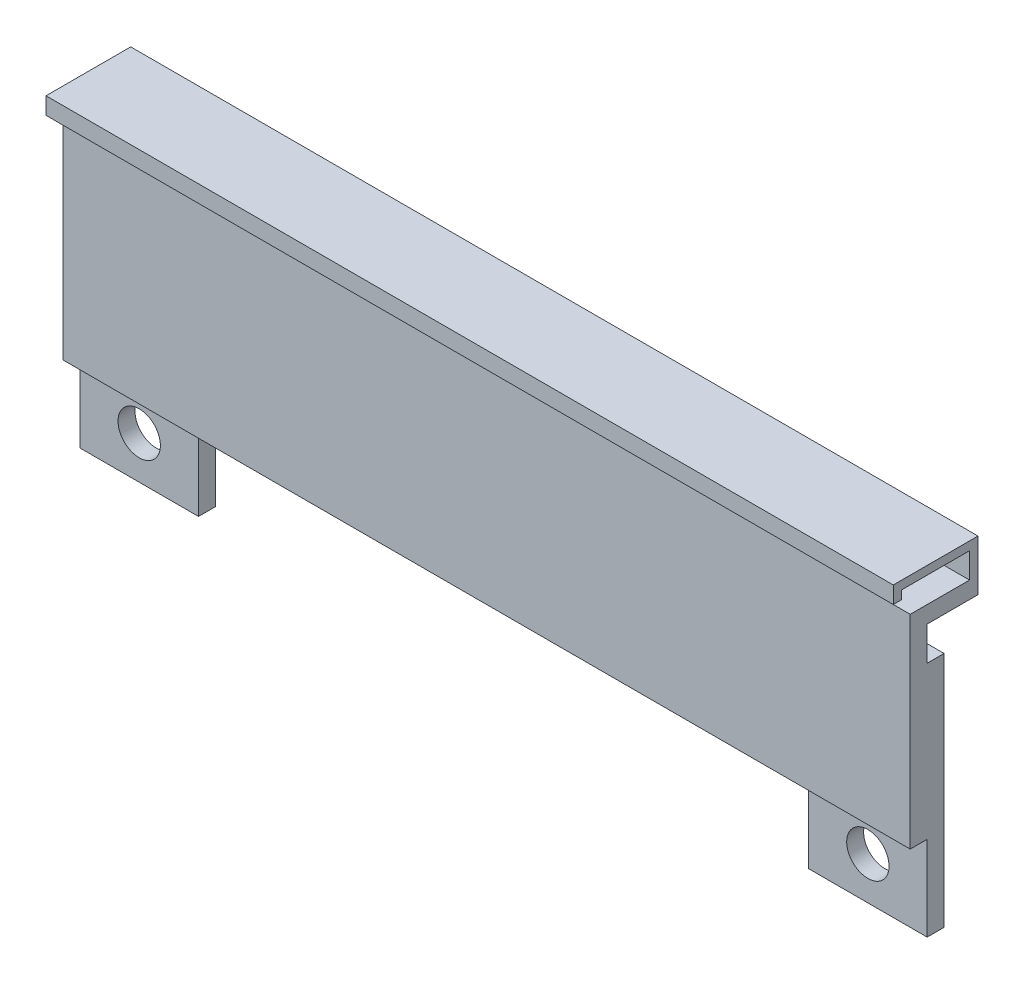
ISO-10303-21;
HEADER;
FILE_DESCRIPTION(('STEP AP214'),'2;1');
FILE_NAME('part.step','',(''),(''),'','','');
FILE_SCHEMA(('AUTOMOTIVE_DESIGN { 1 0 10303 214 1 1 1 1 }'));
ENDSEC;
DATA;
#1=APPLICATION_CONTEXT('core data for automotive mechanical design processes');
#2=APPLICATION_PROTOCOL_DEFINITION('international standard','automotive_design',2000,#1);
#3=PRODUCT_CONTEXT('',#1,'mechanical');
#4=PRODUCT('Part','Part','',(#3));
#5=PRODUCT_RELATED_PRODUCT_CATEGORY('part','',(#4));
#6=PRODUCT_DEFINITION_FORMATION('','',#4);
#7=PRODUCT_DEFINITION_CONTEXT('part definition',#1,'design');
#8=PRODUCT_DEFINITION('design','',#6,#7);
#9=PRODUCT_DEFINITION_SHAPE('','',#8);
#10=(LENGTH_UNIT() NAMED_UNIT(*) SI_UNIT(.MILLI.,.METRE.));
#11=(NAMED_UNIT(*) PLANE_ANGLE_UNIT() SI_UNIT($,.RADIAN.));
#12=(NAMED_UNIT(*) SI_UNIT($,.STERADIAN.) SOLID_ANGLE_UNIT());
#13=UNCERTAINTY_MEASURE_WITH_UNIT(LENGTH_MEASURE(1.E-05),#10,'distance_accuracy_value','');
#14=(GEOMETRIC_REPRESENTATION_CONTEXT(3) GLOBAL_UNCERTAINTY_ASSIGNED_CONTEXT((#13)) GLOBAL_UNIT_ASSIGNED_CONTEXT((#10,
#11,#12)) REPRESENTATION_CONTEXT('',''));
#15=CARTESIAN_POINT('',(0.,0.,0.));
#16=DIRECTION('',(0.,0.,1.));
#17=DIRECTION('',(1.,0.,0.));
#18=AXIS2_PLACEMENT_3D('',#15,#16,#17);
#19=CARTESIAN_POINT('',(0.,0.,-2.));
#20=DIRECTION('',(0.,0.,1.));
#21=DIRECTION('',(1.,0.,0.));
#22=AXIS2_PLACEMENT_3D('',#19,#20,#21);
#23=PLANE('',#22);
#24=DIRECTION('',(0.,-1.,0.));
#25=VECTOR('',#24,1.);
#26=CARTESIAN_POINT('',(-86.,0.,-2.));
#27=LINE('',#26,#25);
#28=CARTESIAN_POINT('',(-86.,10.,-2.));
#29=VERTEX_POINT('',#28);
#30=CARTESIAN_POINT('',(-86.,0.,-2.));
#31=VERTEX_POINT('',#30);
#32=EDGE_CURVE('E183',#29,#31,#27,.T.);
#33=ORIENTED_EDGE('',*,*,#32,.F.);
#34=DIRECTION('',(-1.,0.,0.));
#35=VECTOR('',#34,1.);
#36=CARTESIAN_POINT('',(0.,10.,-2.));
#37=LINE('',#36,#35);
#38=CARTESIAN_POINT('',(-100.,10.,-2.));
#39=VERTEX_POINT('',#38);
#40=EDGE_CURVE('E314',#29,#39,#37,.T.);
#41=ORIENTED_EDGE('',*,*,#40,.T.);
#42=DIRECTION('',(0.,1.,0.));
#43=VECTOR('',#42,1.);
#44=CARTESIAN_POINT('',(-100.,28.,-2.));
#45=LINE('',#44,#43);
#46=CARTESIAN_POINT('',(-100.,0.,-2.));
#47=VERTEX_POINT('',#46);
#48=EDGE_CURVE('E211',#47,#39,#45,.T.);
#49=ORIENTED_EDGE('',*,*,#48,.F.);
#50=DIRECTION('',(-1.,0.,0.));
#51=VECTOR('',#50,1.);
#52=CARTESIAN_POINT('',(-100.,0.,-2.));
#53=LINE('',#52,#51);
#54=EDGE_CURVE('E218',#31,#47,#53,.T.);
#55=ORIENTED_EDGE('',*,*,#54,.F.);
#56=EDGE_LOOP('',(#33,#41,#49,#55));
#57=FACE_BOUND('',#56,.T.);
#58=CARTESIAN_POINT('',(-93.,4.99999999999998,-2.));
#59=DIRECTION('',(0.,0.,-1.));
#60=DIRECTION('',(-1.,0.,0.));
#61=AXIS2_PLACEMENT_3D('',#58,#59,#60);
#62=CIRCLE('',#61,2.5);
#63=CARTESIAN_POINT('',(-95.5,4.99999999999998,-2.));
#64=VERTEX_POINT('',#63);
#65=EDGE_CURVE('E380',#64,#64,#62,.T.);
#66=ORIENTED_EDGE('',*,*,#65,.T.);
#67=EDGE_LOOP('',(#66));
#68=FACE_BOUND('',#67,.T.);
#69=ADVANCED_FACE('F40',(#57,#68),#23,.T.);
#70=CARTESIAN_POINT('',(-100.,0.,-4.));
#71=DIRECTION('',(0.,1.,0.));
#72=DIRECTION('',(0.,0.,1.));
#73=AXIS2_PLACEMENT_3D('',#70,#71,#72);
#74=PLANE('',#73);
#75=DIRECTION('',(-1.,0.,0.));
#76=VECTOR('',#75,1.);
#77=CARTESIAN_POINT('',(-100.,0.,-4.));
#78=LINE('',#77,#76);
#79=CARTESIAN_POINT('',(-86.,0.,-4.));
#80=VERTEX_POINT('',#79);
#81=CARTESIAN_POINT('',(-100.,0.,-4.));
#82=VERTEX_POINT('',#81);
#83=EDGE_CURVE('E194',#80,#82,#78,.T.);
#84=ORIENTED_EDGE('',*,*,#83,.F.);
#85=DIRECTION('',(0.,0.,1.));
#86=VECTOR('',#85,1.);
#87=CARTESIAN_POINT('',(-86.,0.,-4.));
#88=LINE('',#87,#86);
#89=EDGE_CURVE('E177',#80,#31,#88,.T.);
#90=ORIENTED_EDGE('',*,*,#89,.T.);
#91=ORIENTED_EDGE('',*,*,#54,.T.);
#92=DIRECTION('',(0.,0.,1.));
#93=VECTOR('',#92,1.);
#94=CARTESIAN_POINT('',(-100.,0.,-4.));
#95=LINE('',#94,#93);
#96=EDGE_CURVE('E201',#82,#47,#95,.T.);
#97=ORIENTED_EDGE('',*,*,#96,.F.);
#98=EDGE_LOOP('',(#84,#90,#91,#97));
#99=FACE_BOUND('',#98,.T.);
#100=ADVANCED_FACE('F199',(#99),#74,.F.);
#101=CARTESIAN_POINT('',(-100.,0.,2.));
#102=DIRECTION('',(-1.,0.,0.));
#103=DIRECTION('',(0.,0.,1.));
#104=AXIS2_PLACEMENT_3D('',#101,#102,#103);
#105=PLANE('',#104);
#106=DIRECTION('',(0.,0.,1.));
#107=VECTOR('',#106,1.);
#108=CARTESIAN_POINT('',(-100.,10.,-2.));
#109=LINE('',#108,#107);
#110=CARTESIAN_POINT('',(-100.,10.,0.));
#111=VERTEX_POINT('',#110);
#112=EDGE_CURVE('E48',#39,#111,#109,.T.);
#113=ORIENTED_EDGE('',*,*,#112,.T.);
#114=DIRECTION('',(0.,1.,0.));
#115=VECTOR('',#114,1.);
#116=CARTESIAN_POINT('',(-100.,28.,0.));
#117=LINE('',#116,#115);
#118=CARTESIAN_POINT('',(-100.,34.,0.));
#119=VERTEX_POINT('',#118);
#120=EDGE_CURVE('E302',#111,#119,#117,.T.);
#121=ORIENTED_EDGE('',*,*,#120,.T.);
#122=DIRECTION('',(0.,0.,1.));
#123=VECTOR('',#122,1.);
#124=CARTESIAN_POINT('',(-100.,34.,-2.));
#125=LINE('',#124,#123);
#126=CARTESIAN_POINT('',(-100.,34.,-7.));
#127=VERTEX_POINT('',#126);
#128=EDGE_CURVE('E305',#127,#119,#125,.T.);
#129=ORIENTED_EDGE('',*,*,#128,.F.);
#130=DIRECTION('',(0.,1.,0.));
#131=VECTOR('',#130,1.);
#132=CARTESIAN_POINT('',(-100.,32.,-7.));
#133=LINE('',#132,#131);
#134=CARTESIAN_POINT('',(-100.,37.,-7.));
#135=VERTEX_POINT('',#134);
#136=EDGE_CURVE('E269',#127,#135,#133,.T.);
#137=ORIENTED_EDGE('',*,*,#136,.T.);
#138=DIRECTION('',(0.,0.,-1.));
#139=VECTOR('',#138,1.);
#140=CARTESIAN_POINT('',(-100.,37.,2.));
#141=LINE('',#140,#139);
#142=CARTESIAN_POINT('',(-100.,37.,0.999999999999999));
#143=VERTEX_POINT('',#142);
#144=EDGE_CURVE('E264',#143,#135,#141,.T.);
#145=ORIENTED_EDGE('',*,*,#144,.F.);
#146=DIRECTION('',(0.,1.,0.));
#147=VECTOR('',#146,1.);
#148=CARTESIAN_POINT('',(-100.,36.,0.999999999999999));
#149=LINE('',#148,#147);
#150=CARTESIAN_POINT('',(-100.,36.,0.999999999999999));
#151=VERTEX_POINT('',#150);
#152=EDGE_CURVE('E249',#151,#143,#149,.T.);
#153=ORIENTED_EDGE('',*,*,#152,.F.);
#154=DIRECTION('',(0.,0.,-1.));
#155=VECTOR('',#154,1.);
#156=CARTESIAN_POINT('',(-100.,36.,2.));
#157=LINE('',#156,#155);
#158=CARTESIAN_POINT('',(-100.,36.,2.));
#159=VERTEX_POINT('',#158);
#160=EDGE_CURVE('E234',#159,#151,#157,.T.);
#161=ORIENTED_EDGE('',*,*,#160,.F.);
#162=DIRECTION('',(0.,-1.,0.));
#163=VECTOR('',#162,1.);
#164=CARTESIAN_POINT('',(-100.,38.,2.));
#165=LINE('',#164,#163);
#166=CARTESIAN_POINT('',(-100.,38.,2.));
#167=VERTEX_POINT('',#166);
#168=EDGE_CURVE('E252',#167,#159,#165,.T.);
#169=ORIENTED_EDGE('',*,*,#168,.F.);
#170=DIRECTION('',(0.,0.,-1.));
#171=VECTOR('',#170,1.);
#172=CARTESIAN_POINT('',(-100.,38.,-7.));
#173=LINE('',#172,#171);
#174=CARTESIAN_POINT('',(-100.,38.,-8.));
#175=VERTEX_POINT('',#174);
#176=EDGE_CURVE('E272',#167,#175,#173,.T.);
#177=ORIENTED_EDGE('',*,*,#176,.T.);
#178=DIRECTION('',(0.,1.,0.));
#179=VECTOR('',#178,1.);
#180=CARTESIAN_POINT('',(-100.,34.,-8.));
#181=LINE('',#180,#179);
#182=CARTESIAN_POINT('',(-100.,32.,-8.));
#183=VERTEX_POINT('',#182);
#184=EDGE_CURVE('E289',#183,#175,#181,.T.);
#185=ORIENTED_EDGE('',*,*,#184,.F.);
#186=DIRECTION('',(0.,0.,1.));
#187=VECTOR('',#186,1.);
#188=CARTESIAN_POINT('',(-100.,32.,-8.));
#189=LINE('',#188,#187);
#190=CARTESIAN_POINT('',(-100.,32.,-2.));
#191=VERTEX_POINT('',#190);
#192=EDGE_CURVE('E291',#183,#191,#189,.T.);
#193=ORIENTED_EDGE('',*,*,#192,.T.);
#194=DIRECTION('',(0.,1.,0.));
#195=VECTOR('',#194,1.);
#196=CARTESIAN_POINT('',(-100.,12.,-2.));
#197=LINE('',#196,#195);
#198=CARTESIAN_POINT('',(-100.,28.,-2.));
#199=VERTEX_POINT('',#198);
#200=EDGE_CURVE('E318',#199,#191,#197,.T.);
#201=ORIENTED_EDGE('',*,*,#200,.F.);
#202=DIRECTION('',(0.,0.,1.));
#203=VECTOR('',#202,1.);
#204=CARTESIAN_POINT('',(-100.,28.,-4.));
#205=LINE('',#204,#203);
#206=CARTESIAN_POINT('',(-100.,28.,-4.));
#207=VERTEX_POINT('',#206);
#208=EDGE_CURVE('E230',#207,#199,#205,.T.);
#209=ORIENTED_EDGE('',*,*,#208,.F.);
#210=DIRECTION('',(0.,1.,0.));
#211=VECTOR('',#210,1.);
#212=CARTESIAN_POINT('',(-100.,28.,-4.));
#213=LINE('',#212,#211);
#214=EDGE_CURVE('E222',#82,#207,#213,.T.);
#215=ORIENTED_EDGE('',*,*,#214,.F.);
#216=ORIENTED_EDGE('',*,*,#96,.T.);
#217=ORIENTED_EDGE('',*,*,#48,.T.);
#218=EDGE_LOOP('',(#113,#121,#129,#137,#145,#153,#161,#169,#177,#185,#193,#201,#209,#215,#216,#217));
#219=FACE_BOUND('',#218,.T.);
#220=ADVANCED_FACE('F42',(#219),#105,.T.);
#221=CARTESIAN_POINT('',(0.,0.,2.));
#222=DIRECTION('',(-1.,0.,0.));
#223=DIRECTION('',(0.,-1.,0.));
#224=AXIS2_PLACEMENT_3D('',#221,#222,#223);
#225=PLANE('',#224);
#226=DIRECTION('',(0.,1.,0.));
#227=VECTOR('',#226,1.);
#228=CARTESIAN_POINT('',(0.,28.,0.));
#229=LINE('',#228,#227);
#230=CARTESIAN_POINT('',(0.,10.,0.));
#231=VERTEX_POINT('',#230);
#232=CARTESIAN_POINT('',(0.,34.,0.));
#233=VERTEX_POINT('',#232);
#234=EDGE_CURVE('E301',#231,#233,#229,.T.);
#235=ORIENTED_EDGE('',*,*,#234,.F.);
#236=DIRECTION('',(0.,0.,1.));
#237=VECTOR('',#236,1.);
#238=CARTESIAN_POINT('',(0.,10.,-2.));
#239=LINE('',#238,#237);
#240=CARTESIAN_POINT('',(0.,10.,-2.));
#241=VERTEX_POINT('',#240);
#242=EDGE_CURVE('E11',#241,#231,#239,.T.);
#243=ORIENTED_EDGE('',*,*,#242,.F.);
#244=DIRECTION('',(0.,-1.,0.));
#245=VECTOR('',#244,1.);
#246=CARTESIAN_POINT('',(0.,28.,-2.));
#247=LINE('',#246,#245);
#248=CARTESIAN_POINT('',(0.,0.,-2.));
#249=VERTEX_POINT('',#248);
#250=EDGE_CURVE('E216',#241,#249,#247,.T.);
#251=ORIENTED_EDGE('',*,*,#250,.T.);
#252=DIRECTION('',(0.,0.,1.));
#253=VECTOR('',#252,1.);
#254=CARTESIAN_POINT('',(0.,0.,-4.));
#255=LINE('',#254,#253);
#256=CARTESIAN_POINT('',(0.,0.,-4.));
#257=VERTEX_POINT('',#256);
#258=EDGE_CURVE('E224',#257,#249,#255,.T.);
#259=ORIENTED_EDGE('',*,*,#258,.F.);
#260=DIRECTION('',(0.,-1.,0.));
#261=VECTOR('',#260,1.);
#262=CARTESIAN_POINT('',(0.,28.,-4.));
#263=LINE('',#262,#261);
#264=CARTESIAN_POINT('',(0.,28.,-4.));
#265=VERTEX_POINT('',#264);
#266=EDGE_CURVE('E204',#265,#257,#263,.T.);
#267=ORIENTED_EDGE('',*,*,#266,.F.);
#268=DIRECTION('',(0.,0.,1.));
#269=VECTOR('',#268,1.);
#270=CARTESIAN_POINT('',(0.,28.,-4.));
#271=LINE('',#270,#269);
#272=CARTESIAN_POINT('',(0.,28.,-2.));
#273=VERTEX_POINT('',#272);
#274=EDGE_CURVE('E227',#265,#273,#271,.T.);
#275=ORIENTED_EDGE('',*,*,#274,.T.);
#276=DIRECTION('',(0.,-1.,0.));
#277=VECTOR('',#276,1.);
#278=CARTESIAN_POINT('',(0.,12.,-2.));
#279=LINE('',#278,#277);
#280=CARTESIAN_POINT('',(0.,32.,-2.));
#281=VERTEX_POINT('',#280);
#282=EDGE_CURVE('E312',#281,#273,#279,.T.);
#283=ORIENTED_EDGE('',*,*,#282,.F.);
#284=DIRECTION('',(0.,0.,1.));
#285=VECTOR('',#284,1.);
#286=CARTESIAN_POINT('',(0.,32.,-8.));
#287=LINE('',#286,#285);
#288=CARTESIAN_POINT('',(0.,32.,-8.));
#289=VERTEX_POINT('',#288);
#290=EDGE_CURVE('E296',#289,#281,#287,.T.);
#291=ORIENTED_EDGE('',*,*,#290,.F.);
#292=DIRECTION('',(0.,-1.,0.));
#293=VECTOR('',#292,1.);
#294=CARTESIAN_POINT('',(0.,34.,-8.));
#295=LINE('',#294,#293);
#296=CARTESIAN_POINT('',(0.,38.,-8.));
#297=VERTEX_POINT('',#296);
#298=EDGE_CURVE('E284',#297,#289,#295,.T.);
#299=ORIENTED_EDGE('',*,*,#298,.F.);
#300=DIRECTION('',(0.,0.,-1.));
#301=VECTOR('',#300,1.);
#302=CARTESIAN_POINT('',(0.,38.,-7.));
#303=LINE('',#302,#301);
#304=CARTESIAN_POINT('',(0.,38.,2.));
#305=VERTEX_POINT('',#304);
#306=EDGE_CURVE('E275',#305,#297,#303,.T.);
#307=ORIENTED_EDGE('',*,*,#306,.F.);
#308=DIRECTION('',(0.,1.,0.));
#309=VECTOR('',#308,1.);
#310=CARTESIAN_POINT('',(0.,38.,2.));
#311=LINE('',#310,#309);
#312=CARTESIAN_POINT('',(0.,36.,2.));
#313=VERTEX_POINT('',#312);
#314=EDGE_CURVE('E254',#313,#305,#311,.T.);
#315=ORIENTED_EDGE('',*,*,#314,.F.);
#316=DIRECTION('',(0.,0.,1.));
#317=VECTOR('',#316,1.);
#318=CARTESIAN_POINT('',(0.,36.,2.));
#319=LINE('',#318,#317);
#320=CARTESIAN_POINT('',(0.,36.,0.999999999999999));
#321=VERTEX_POINT('',#320);
#322=EDGE_CURVE('E239',#321,#313,#319,.T.);
#323=ORIENTED_EDGE('',*,*,#322,.F.);
#324=DIRECTION('',(0.,1.,0.));
#325=VECTOR('',#324,1.);
#326=CARTESIAN_POINT('',(0.,36.,0.999999999999999));
#327=LINE('',#326,#325);
#328=CARTESIAN_POINT('',(0.,37.,0.999999999999999));
#329=VERTEX_POINT('',#328);
#330=EDGE_CURVE('E245',#321,#329,#327,.T.);
#331=ORIENTED_EDGE('',*,*,#330,.T.);
#332=DIRECTION('',(0.,0.,-1.));
#333=VECTOR('',#332,1.);
#334=CARTESIAN_POINT('',(0.,37.,2.));
#335=LINE('',#334,#333);
#336=CARTESIAN_POINT('',(0.,37.,-7.));
#337=VERTEX_POINT('',#336);
#338=EDGE_CURVE('E260',#329,#337,#335,.T.);
#339=ORIENTED_EDGE('',*,*,#338,.T.);
#340=DIRECTION('',(0.,-1.,0.));
#341=VECTOR('',#340,1.);
#342=CARTESIAN_POINT('',(0.,32.,-7.));
#343=LINE('',#342,#341);
#344=CARTESIAN_POINT('',(0.,34.,-7.));
#345=VERTEX_POINT('',#344);
#346=EDGE_CURVE('E267',#337,#345,#343,.T.);
#347=ORIENTED_EDGE('',*,*,#346,.T.);
#348=DIRECTION('',(0.,0.,-1.));
#349=VECTOR('',#348,1.);
#350=CARTESIAN_POINT('',(0.,34.,-2.));
#351=LINE('',#350,#349);
#352=EDGE_CURVE('E308',#233,#345,#351,.T.);
#353=ORIENTED_EDGE('',*,*,#352,.F.);
#354=EDGE_LOOP('',(#235,#243,#251,#259,#267,#275,#283,#291,#299,#307,#315,#323,#331,#339,#347,#353));
#355=FACE_BOUND('',#354,.T.);
#356=ADVANCED_FACE('F339',(#355),#225,.F.);
#357=CARTESIAN_POINT('',(0.,0.,-2.));
#358=DIRECTION('',(0.,0.,-1.));
#359=DIRECTION('',(-1.,0.,0.));
#360=AXIS2_PLACEMENT_3D('',#357,#358,#359);
#361=PLANE('',#360);
#362=ORIENTED_EDGE('',*,*,#282,.T.);
#363=DIRECTION('',(1.,0.,0.));
#364=VECTOR('',#363,1.);
#365=CARTESIAN_POINT('',(-100.,28.,-2.));
#366=LINE('',#365,#364);
#367=EDGE_CURVE('E63',#199,#273,#366,.T.);
#368=ORIENTED_EDGE('',*,*,#367,.F.);
#369=ORIENTED_EDGE('',*,*,#200,.T.);
#370=DIRECTION('',(-1.,0.,0.));
#371=VECTOR('',#370,1.);
#372=CARTESIAN_POINT('',(0.,32.,-2.));
#373=LINE('',#372,#371);
#374=EDGE_CURVE('E283',#281,#191,#373,.T.);
#375=ORIENTED_EDGE('',*,*,#374,.F.);
#376=EDGE_LOOP('',(#362,#368,#369,#375));
#377=FACE_BOUND('',#376,.T.);
#378=ADVANCED_FACE('F444',(#377),#361,.T.);
#379=CARTESIAN_POINT('',(-100.,37.,2.));
#380=DIRECTION('',(0.,1.,0.));
#381=DIRECTION('',(0.,0.,1.));
#382=AXIS2_PLACEMENT_3D('',#379,#380,#381);
#383=PLANE('',#382);
#384=DIRECTION('',(1.,0.,0.));
#385=VECTOR('',#384,1.);
#386=CARTESIAN_POINT('',(-100.,37.,0.999999999999999));
#387=LINE('',#386,#385);
#388=EDGE_CURVE('E233',#143,#329,#387,.T.);
#389=ORIENTED_EDGE('',*,*,#388,.F.);
#390=ORIENTED_EDGE('',*,*,#144,.T.);
#391=DIRECTION('',(1.,0.,0.));
#392=VECTOR('',#391,1.);
#393=CARTESIAN_POINT('',(-100.,37.,-7.));
#394=LINE('',#393,#392);
#395=EDGE_CURVE('E251',#135,#337,#394,.T.);
#396=ORIENTED_EDGE('',*,*,#395,.T.);
#397=ORIENTED_EDGE('',*,*,#338,.F.);
#398=EDGE_LOOP('',(#389,#390,#396,#397));
#399=FACE_BOUND('',#398,.T.);
#400=ADVANCED_FACE('F350',(#399),#383,.F.);
#401=CARTESIAN_POINT('',(0.,0.,-7.));
#402=DIRECTION('',(0.,0.,1.));
#403=DIRECTION('',(1.,0.,0.));
#404=AXIS2_PLACEMENT_3D('',#401,#402,#403);
#405=PLANE('',#404);
#406=ORIENTED_EDGE('',*,*,#346,.F.);
#407=ORIENTED_EDGE('',*,*,#395,.F.);
#408=ORIENTED_EDGE('',*,*,#136,.F.);
#409=DIRECTION('',(1.,0.,0.));
#410=VECTOR('',#409,1.);
#411=CARTESIAN_POINT('',(0.,34.,-7.));
#412=LINE('',#411,#410);
#413=EDGE_CURVE('E278',#127,#345,#412,.T.);
#414=ORIENTED_EDGE('',*,*,#413,.T.);
#415=EDGE_LOOP('',(#406,#407,#408,#414));
#416=FACE_BOUND('',#415,.T.);
#417=ADVANCED_FACE('F344',(#416),#405,.T.);
#418=CARTESIAN_POINT('',(0.,10.,-2.));
#419=DIRECTION('',(0.,1.,0.));
#420=DIRECTION('',(0.,0.,1.));
#421=AXIS2_PLACEMENT_3D('',#418,#419,#420);
#422=PLANE('',#421);
#423=DIRECTION('',(-1.,0.,0.));
#424=VECTOR('',#423,1.);
#425=CARTESIAN_POINT('',(0.,10.,0.));
#426=LINE('',#425,#424);
#427=EDGE_CURVE('E311',#231,#111,#426,.T.);
#428=ORIENTED_EDGE('',*,*,#427,.T.);
#429=ORIENTED_EDGE('',*,*,#112,.F.);
#430=ORIENTED_EDGE('',*,*,#40,.F.);
#431=DIRECTION('',(0.,0.,1.));
#432=VECTOR('',#431,1.);
#433=CARTESIAN_POINT('',(-86.,10.,-4.));
#434=LINE('',#433,#432);
#435=CARTESIAN_POINT('',(-86.,10.,-4.));
#436=VERTEX_POINT('',#435);
#437=EDGE_CURVE('E389',#436,#29,#434,.T.);
#438=ORIENTED_EDGE('',*,*,#437,.F.);
#439=DIRECTION('',(-1.,0.,0.));
#440=VECTOR('',#439,1.);
#441=CARTESIAN_POINT('',(-86.,10.,-4.));
#442=LINE('',#441,#440);
#443=CARTESIAN_POINT('',(-14.,10.,-4.));
#444=VERTEX_POINT('',#443);
#445=EDGE_CURVE('E188',#444,#436,#442,.T.);
#446=ORIENTED_EDGE('',*,*,#445,.F.);
#447=DIRECTION('',(0.,0.,1.));
#448=VECTOR('',#447,1.);
#449=CARTESIAN_POINT('',(-14.,10.,-4.));
#450=LINE('',#449,#448);
#451=CARTESIAN_POINT('',(-14.,10.,-2.));
#452=VERTEX_POINT('',#451);
#453=EDGE_CURVE('E393',#444,#452,#450,.T.);
#454=ORIENTED_EDGE('',*,*,#453,.T.);
#455=EDGE_CURVE('E315',#241,#452,#37,.T.);
#456=ORIENTED_EDGE('',*,*,#455,.F.);
#457=ORIENTED_EDGE('',*,*,#242,.T.);
#458=EDGE_LOOP('',(#428,#429,#430,#438,#446,#454,#456,#457));
#459=FACE_BOUND('',#458,.T.);
#460=ADVANCED_FACE('F328',(#459),#422,.F.);
#461=CARTESIAN_POINT('',(0.,34.,0.));
#462=DIRECTION('',(0.,1.,0.));
#463=DIRECTION('',(-1.,0.,0.));
#464=AXIS2_PLACEMENT_3D('',#461,#462,#463);
#465=PLANE('',#464);
#466=ORIENTED_EDGE('',*,*,#413,.F.);
#467=ORIENTED_EDGE('',*,*,#128,.T.);
#468=DIRECTION('',(-1.,0.,0.));
#469=VECTOR('',#468,1.);
#470=CARTESIAN_POINT('',(-100.,34.,0.));
#471=LINE('',#470,#469);
#472=EDGE_CURVE('E298',#233,#119,#471,.T.);
#473=ORIENTED_EDGE('',*,*,#472,.F.);
#474=ORIENTED_EDGE('',*,*,#352,.T.);
#475=EDGE_LOOP('',(#466,#467,#473,#474));
#476=FACE_BOUND('',#475,.T.);
#477=ADVANCED_FACE('F337',(#476),#465,.T.);
#478=CARTESIAN_POINT('',(-100.,28.,0.));
#479=DIRECTION('',(0.,0.,-1.));
#480=DIRECTION('',(-1.,0.,0.));
#481=AXIS2_PLACEMENT_3D('',#478,#479,#480);
#482=PLANE('',#481);
#483=ORIENTED_EDGE('',*,*,#472,.T.);
#484=ORIENTED_EDGE('',*,*,#120,.F.);
#485=ORIENTED_EDGE('',*,*,#427,.F.);
#486=ORIENTED_EDGE('',*,*,#234,.T.);
#487=EDGE_LOOP('',(#483,#484,#485,#486));
#488=FACE_BOUND('',#487,.T.);
#489=ADVANCED_FACE('F332',(#488),#482,.F.);
#490=CARTESIAN_POINT('',(0.,32.,-8.));
#491=DIRECTION('',(0.,1.,0.));
#492=DIRECTION('',(0.,0.,1.));
#493=AXIS2_PLACEMENT_3D('',#490,#491,#492);
#494=PLANE('',#493);
#495=ORIENTED_EDGE('',*,*,#374,.T.);
#496=ORIENTED_EDGE('',*,*,#192,.F.);
#497=DIRECTION('',(-1.,0.,0.));
#498=VECTOR('',#497,1.);
#499=CARTESIAN_POINT('',(0.,32.,-8.));
#500=LINE('',#499,#498);
#501=EDGE_CURVE('E287',#289,#183,#500,.T.);
#502=ORIENTED_EDGE('',*,*,#501,.F.);
#503=ORIENTED_EDGE('',*,*,#290,.T.);
#504=EDGE_LOOP('',(#495,#496,#502,#503));
#505=FACE_BOUND('',#504,.T.);
#506=ADVANCED_FACE('F371',(#505),#494,.F.);
#507=CARTESIAN_POINT('',(0.,0.,-8.));
#508=DIRECTION('',(0.,0.,-1.));
#509=DIRECTION('',(-1.,0.,0.));
#510=AXIS2_PLACEMENT_3D('',#507,#508,#509);
#511=PLANE('',#510);
#512=ORIENTED_EDGE('',*,*,#298,.T.);
#513=ORIENTED_EDGE('',*,*,#501,.T.);
#514=ORIENTED_EDGE('',*,*,#184,.T.);
#515=DIRECTION('',(1.,0.,0.));
#516=VECTOR('',#515,1.);
#517=CARTESIAN_POINT('',(0.,38.,-8.));
#518=LINE('',#517,#516);
#519=EDGE_CURVE('E266',#175,#297,#518,.T.);
#520=ORIENTED_EDGE('',*,*,#519,.T.);
#521=EDGE_LOOP('',(#512,#513,#514,#520));
#522=FACE_BOUND('',#521,.T.);
#523=ADVANCED_FACE('F367',(#522),#511,.T.);
#524=CARTESIAN_POINT('',(0.,38.,-7.));
#525=DIRECTION('',(0.,1.,0.));
#526=DIRECTION('',(0.,0.,1.));
#527=AXIS2_PLACEMENT_3D('',#524,#525,#526);
#528=PLANE('',#527);
#529=ORIENTED_EDGE('',*,*,#519,.F.);
#530=ORIENTED_EDGE('',*,*,#176,.F.);
#531=DIRECTION('',(-1.,0.,0.));
#532=VECTOR('',#531,1.);
#533=CARTESIAN_POINT('',(-100.,38.,2.));
#534=LINE('',#533,#532);
#535=EDGE_CURVE('E257',#305,#167,#534,.T.);
#536=ORIENTED_EDGE('',*,*,#535,.F.);
#537=ORIENTED_EDGE('',*,*,#306,.T.);
#538=EDGE_LOOP('',(#529,#530,#536,#537));
#539=FACE_BOUND('',#538,.T.);
#540=ADVANCED_FACE('F365',(#539),#528,.T.);
#541=CARTESIAN_POINT('',(0.,0.,2.));
#542=DIRECTION('',(0.,0.,1.));
#543=DIRECTION('',(1.,0.,0.));
#544=AXIS2_PLACEMENT_3D('',#541,#542,#543);
#545=PLANE('',#544);
#546=ORIENTED_EDGE('',*,*,#168,.T.);
#547=DIRECTION('',(-1.,0.,0.));
#548=VECTOR('',#547,1.);
#549=CARTESIAN_POINT('',(-100.,36.,2.));
#550=LINE('',#549,#548);
#551=EDGE_CURVE('E242',#313,#159,#550,.T.);
#552=ORIENTED_EDGE('',*,*,#551,.F.);
#553=ORIENTED_EDGE('',*,*,#314,.T.);
#554=ORIENTED_EDGE('',*,*,#535,.T.);
#555=EDGE_LOOP('',(#546,#552,#553,#554));
#556=FACE_BOUND('',#555,.T.);
#557=ADVANCED_FACE('F359',(#556),#545,.T.);
#558=CARTESIAN_POINT('',(-100.,36.,0.999999999999999));
#559=DIRECTION('',(0.,0.,1.));
#560=DIRECTION('',(1.,0.,0.));
#561=AXIS2_PLACEMENT_3D('',#558,#559,#560);
#562=PLANE('',#561);
#563=ORIENTED_EDGE('',*,*,#388,.T.);
#564=ORIENTED_EDGE('',*,*,#330,.F.);
#565=DIRECTION('',(1.,0.,0.));
#566=VECTOR('',#565,1.);
#567=CARTESIAN_POINT('',(-100.,36.,0.999999999999999));
#568=LINE('',#567,#566);
#569=EDGE_CURVE('E237',#151,#321,#568,.T.);
#570=ORIENTED_EDGE('',*,*,#569,.F.);
#571=ORIENTED_EDGE('',*,*,#152,.T.);
#572=EDGE_LOOP('',(#563,#564,#570,#571));
#573=FACE_BOUND('',#572,.T.);
#574=ADVANCED_FACE('F353',(#573),#562,.F.);
#575=CARTESIAN_POINT('',(0.,36.,0.));
#576=DIRECTION('',(0.,-1.,0.));
#577=DIRECTION('',(0.,0.,-1.));
#578=AXIS2_PLACEMENT_3D('',#575,#576,#577);
#579=PLANE('',#578);
#580=ORIENTED_EDGE('',*,*,#160,.T.);
#581=ORIENTED_EDGE('',*,*,#569,.T.);
#582=ORIENTED_EDGE('',*,*,#322,.T.);
#583=ORIENTED_EDGE('',*,*,#551,.T.);
#584=EDGE_LOOP('',(#580,#581,#582,#583));
#585=FACE_BOUND('',#584,.T.);
#586=ADVANCED_FACE('F357',(#585),#579,.T.);
#587=DIRECTION('',(0.,1.,0.));
#588=VECTOR('',#587,1.);
#589=CARTESIAN_POINT('',(-14.,0.,-2.));
#590=LINE('',#589,#588);
#591=CARTESIAN_POINT('',(-14.,0.,-2.));
#592=VERTEX_POINT('',#591);
#593=EDGE_CURVE('E197',#592,#452,#590,.T.);
#594=ORIENTED_EDGE('',*,*,#593,.F.);
#595=EDGE_CURVE('E219',#249,#592,#53,.T.);
#596=ORIENTED_EDGE('',*,*,#595,.F.);
#597=ORIENTED_EDGE('',*,*,#250,.F.);
#598=ORIENTED_EDGE('',*,*,#455,.T.);
#599=EDGE_LOOP('',(#594,#596,#597,#598));
#600=FACE_BOUND('',#599,.T.);
#601=CARTESIAN_POINT('',(-7.00000000000001,4.99999999999998,-2.));
#602=DIRECTION('',(0.,0.,-1.));
#603=DIRECTION('',(-1.,0.,0.));
#604=AXIS2_PLACEMENT_3D('',#601,#602,#603);
#605=CIRCLE('',#604,2.5);
#606=CARTESIAN_POINT('',(-9.50000000000001,4.99999999999998,-2.));
#607=VERTEX_POINT('',#606);
#608=EDGE_CURVE('E386',#607,#607,#605,.T.);
#609=ORIENTED_EDGE('',*,*,#608,.T.);
#610=EDGE_LOOP('',(#609));
#611=FACE_BOUND('',#610,.T.);
#612=ADVANCED_FACE('F408',(#600,#611),#23,.T.);
#613=CARTESIAN_POINT('',(0.,0.,-4.));
#614=DIRECTION('',(0.,0.,1.));
#615=DIRECTION('',(1.,0.,0.));
#616=AXIS2_PLACEMENT_3D('',#613,#614,#615);
#617=PLANE('',#616);
#618=ORIENTED_EDGE('',*,*,#445,.T.);
#619=DIRECTION('',(0.,-1.,0.));
#620=VECTOR('',#619,1.);
#621=CARTESIAN_POINT('',(-86.,0.,-4.));
#622=LINE('',#621,#620);
#623=EDGE_CURVE('E180',#436,#80,#622,.T.);
#624=ORIENTED_EDGE('',*,*,#623,.T.);
#625=ORIENTED_EDGE('',*,*,#83,.T.);
#626=ORIENTED_EDGE('',*,*,#214,.T.);
#627=DIRECTION('',(1.,0.,0.));
#628=VECTOR('',#627,1.);
#629=CARTESIAN_POINT('',(-100.,28.,-4.));
#630=LINE('',#629,#628);
#631=EDGE_CURVE('E207',#207,#265,#630,.T.);
#632=ORIENTED_EDGE('',*,*,#631,.T.);
#633=ORIENTED_EDGE('',*,*,#266,.T.);
#634=CARTESIAN_POINT('',(-14.,0.,-4.));
#635=VERTEX_POINT('',#634);
#636=EDGE_CURVE('E203',#257,#635,#78,.T.);
#637=ORIENTED_EDGE('',*,*,#636,.T.);
#638=DIRECTION('',(0.,1.,0.));
#639=VECTOR('',#638,1.);
#640=CARTESIAN_POINT('',(-14.,0.,-4.));
#641=LINE('',#640,#639);
#642=EDGE_CURVE('E55',#635,#444,#641,.T.);
#643=ORIENTED_EDGE('',*,*,#642,.T.);
#644=EDGE_LOOP('',(#618,#624,#625,#626,#632,#633,#637,#643));
#645=FACE_BOUND('',#644,.T.);
#646=CARTESIAN_POINT('',(-93.,4.99999999999998,-4.));
#647=DIRECTION('',(0.,0.,-1.));
#648=DIRECTION('',(-1.,0.,0.));
#649=AXIS2_PLACEMENT_3D('',#646,#647,#648);
#650=CIRCLE('',#649,2.5);
#651=CARTESIAN_POINT('',(-95.5,4.99999999999998,-4.));
#652=VERTEX_POINT('',#651);
#653=EDGE_CURVE('E214',#652,#652,#650,.T.);
#654=ORIENTED_EDGE('',*,*,#653,.F.);
#655=EDGE_LOOP('',(#654));
#656=FACE_BOUND('',#655,.T.);
#657=CARTESIAN_POINT('',(-7.00000000000001,4.99999999999998,-4.));
#658=DIRECTION('',(0.,0.,-1.));
#659=DIRECTION('',(-1.,0.,0.));
#660=AXIS2_PLACEMENT_3D('',#657,#658,#659);
#661=CIRCLE('',#660,2.5);
#662=CARTESIAN_POINT('',(-9.50000000000001,4.99999999999998,-4.));
#663=VERTEX_POINT('',#662);
#664=EDGE_CURVE('E383',#663,#663,#661,.T.);
#665=ORIENTED_EDGE('',*,*,#664,.F.);
#666=EDGE_LOOP('',(#665));
#667=FACE_BOUND('',#666,.T.);
#668=ADVANCED_FACE('F191',(#645,#656,#667),#617,.F.);
#669=CARTESIAN_POINT('',(-100.,28.,-4.));
#670=DIRECTION('',(0.,-1.,0.));
#671=DIRECTION('',(1.,0.,0.));
#672=AXIS2_PLACEMENT_3D('',#669,#670,#671);
#673=PLANE('',#672);
#674=ORIENTED_EDGE('',*,*,#367,.T.);
#675=ORIENTED_EDGE('',*,*,#274,.F.);
#676=ORIENTED_EDGE('',*,*,#631,.F.);
#677=ORIENTED_EDGE('',*,*,#208,.T.);
#678=EDGE_LOOP('',(#674,#675,#676,#677));
#679=FACE_BOUND('',#678,.T.);
#680=ADVANCED_FACE('F375',(#679),#673,.F.);
#681=ORIENTED_EDGE('',*,*,#595,.T.);
#682=DIRECTION('',(0.,0.,1.));
#683=VECTOR('',#682,1.);
#684=CARTESIAN_POINT('',(-14.,0.,-4.));
#685=LINE('',#684,#683);
#686=EDGE_CURVE('E187',#635,#592,#685,.T.);
#687=ORIENTED_EDGE('',*,*,#686,.F.);
#688=ORIENTED_EDGE('',*,*,#636,.F.);
#689=ORIENTED_EDGE('',*,*,#258,.T.);
#690=EDGE_LOOP('',(#681,#687,#688,#689));
#691=FACE_BOUND('',#690,.T.);
#692=ADVANCED_FACE('F403',(#691),#74,.F.);
#693=CARTESIAN_POINT('',(-93.,4.99999999999998,-4.));
#694=DIRECTION('',(0.,0.,1.));
#695=DIRECTION('',(1.,0.,0.));
#696=AXIS2_PLACEMENT_3D('',#693,#694,#695);
#697=CYLINDRICAL_SURFACE('',#696,2.5);
#698=ORIENTED_EDGE('',*,*,#653,.T.);
#699=EDGE_LOOP('',(#698));
#700=FACE_BOUND('',#699,.T.);
#701=ORIENTED_EDGE('',*,*,#65,.F.);
#702=EDGE_LOOP('',(#701));
#703=FACE_BOUND('',#702,.T.);
#704=ADVANCED_FACE('F417',(#700,#703),#697,.F.);
#705=CARTESIAN_POINT('',(-7.00000000000001,4.99999999999998,-4.));
#706=DIRECTION('',(0.,0.,1.));
#707=DIRECTION('',(1.,0.,0.));
#708=AXIS2_PLACEMENT_3D('',#705,#706,#707);
#709=CYLINDRICAL_SURFACE('',#708,2.5);
#710=ORIENTED_EDGE('',*,*,#664,.T.);
#711=EDGE_LOOP('',(#710));
#712=FACE_BOUND('',#711,.T.);
#713=ORIENTED_EDGE('',*,*,#608,.F.);
#714=EDGE_LOOP('',(#713));
#715=FACE_BOUND('',#714,.T.);
#716=ADVANCED_FACE('F419',(#712,#715),#709,.F.);
#717=CARTESIAN_POINT('',(-86.,0.,-4.));
#718=DIRECTION('',(-1.,0.,0.));
#719=DIRECTION('',(0.,0.,1.));
#720=AXIS2_PLACEMENT_3D('',#717,#718,#719);
#721=PLANE('',#720);
#722=ORIENTED_EDGE('',*,*,#32,.T.);
#723=ORIENTED_EDGE('',*,*,#89,.F.);
#724=ORIENTED_EDGE('',*,*,#623,.F.);
#725=ORIENTED_EDGE('',*,*,#437,.T.);
#726=EDGE_LOOP('',(#722,#723,#724,#725));
#727=FACE_BOUND('',#726,.T.);
#728=ADVANCED_FACE('F179',(#727),#721,.F.);
#729=CARTESIAN_POINT('',(-14.,0.,-4.));
#730=DIRECTION('',(1.,0.,0.));
#731=DIRECTION('',(0.,1.,0.));
#732=AXIS2_PLACEMENT_3D('',#729,#730,#731);
#733=PLANE('',#732);
#734=ORIENTED_EDGE('',*,*,#593,.T.);
#735=ORIENTED_EDGE('',*,*,#453,.F.);
#736=ORIENTED_EDGE('',*,*,#642,.F.);
#737=ORIENTED_EDGE('',*,*,#686,.T.);
#738=EDGE_LOOP('',(#734,#735,#736,#737));
#739=FACE_BOUND('',#738,.T.);
#740=ADVANCED_FACE('F406',(#739),#733,.F.);
#741=CLOSED_SHELL('',(#69,#100,#220,#356,#378,#400,#417,#460,#477,#489,#506,#523,#540,#557,#574,
#586,#612,#668,#680,#692,#704,#716,#728,#740));
#742=MANIFOLD_SOLID_BREP('B2',#741);
#743=ADVANCED_BREP_SHAPE_REPRESENTATION('',(#18,#742),#14);
#744=SHAPE_DEFINITION_REPRESENTATION(#9,#743);
ENDSEC;
END-ISO-10303-21;
